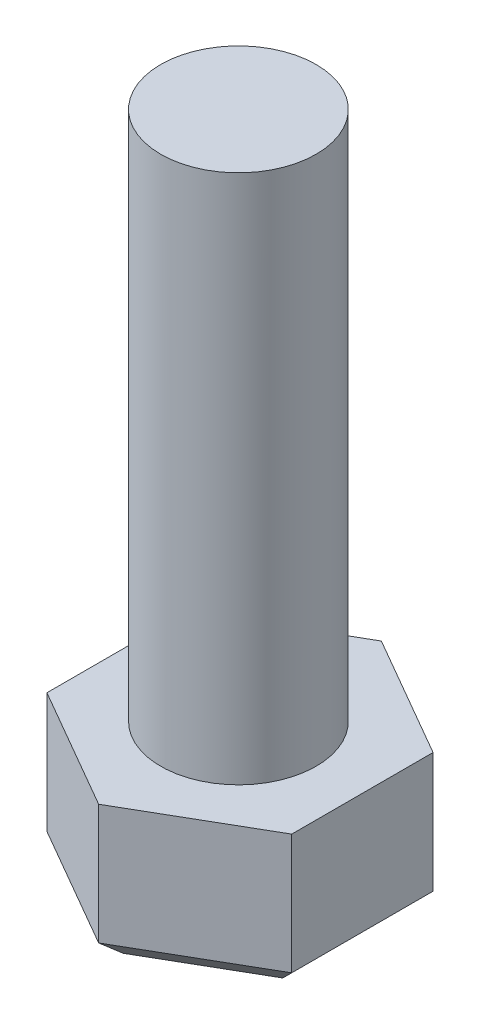
ISO-10303-21;
HEADER;
FILE_DESCRIPTION(('STEP AP214'),'2;1');
FILE_NAME('part.step','',(''),(''),'','','');
FILE_SCHEMA(('AUTOMOTIVE_DESIGN { 1 0 10303 214 1 1 1 1 }'));
ENDSEC;
DATA;
#1=APPLICATION_CONTEXT('core data for automotive mechanical design processes');
#2=APPLICATION_PROTOCOL_DEFINITION('international standard','automotive_design',2000,#1);
#3=PRODUCT_CONTEXT('',#1,'mechanical');
#4=PRODUCT('Part','Part','',(#3));
#5=PRODUCT_RELATED_PRODUCT_CATEGORY('part','',(#4));
#6=PRODUCT_DEFINITION_FORMATION('','',#4);
#7=PRODUCT_DEFINITION_CONTEXT('part definition',#1,'design');
#8=PRODUCT_DEFINITION('design','',#6,#7);
#9=PRODUCT_DEFINITION_SHAPE('','',#8);
#10=(LENGTH_UNIT() NAMED_UNIT(*) SI_UNIT(.MILLI.,.METRE.));
#11=(NAMED_UNIT(*) PLANE_ANGLE_UNIT() SI_UNIT($,.RADIAN.));
#12=(NAMED_UNIT(*) SI_UNIT($,.STERADIAN.) SOLID_ANGLE_UNIT());
#13=UNCERTAINTY_MEASURE_WITH_UNIT(LENGTH_MEASURE(1.E-05),#10,'distance_accuracy_value','');
#14=(GEOMETRIC_REPRESENTATION_CONTEXT(3) GLOBAL_UNCERTAINTY_ASSIGNED_CONTEXT((#13)) GLOBAL_UNIT_ASSIGNED_CONTEXT((#10,
#11,#12)) REPRESENTATION_CONTEXT('',''));
#15=CARTESIAN_POINT('',(0.,0.,0.));
#16=DIRECTION('',(0.,0.,1.));
#17=DIRECTION('',(1.,0.,0.));
#18=AXIS2_PLACEMENT_3D('',#15,#16,#17);
#19=CARTESIAN_POINT('',(0.,75.,-7.105427357601E-12));
#20=DIRECTION('',(0.,-1.,0.));
#21=DIRECTION('',(0.,0.,-1.));
#22=AXIS2_PLACEMENT_3D('',#19,#20,#21);
#23=CYLINDRICAL_SURFACE('',#22,11.0000000000241);
#24=CARTESIAN_POINT('',(0.,75.,-7.105427357601E-12));
#25=DIRECTION('',(0.,1.,0.));
#26=DIRECTION('',(0.,0.,1.));
#27=AXIS2_PLACEMENT_3D('',#24,#25,#26);
#28=CIRCLE('',#27,11.0000000000241);
#29=CARTESIAN_POINT('',(0.,75.,11.000000000017));
#30=VERTEX_POINT('',#29);
#31=EDGE_CURVE('E156',#30,#30,#28,.T.);
#32=ORIENTED_EDGE('',*,*,#31,.F.);
#33=EDGE_LOOP('',(#32));
#34=FACE_BOUND('',#33,.T.);
#35=CARTESIAN_POINT('',(0.,0.,-7.105427357601E-12));
#36=DIRECTION('',(0.,-1.,0.));
#37=DIRECTION('',(0.,0.,-1.));
#38=AXIS2_PLACEMENT_3D('',#35,#36,#37);
#39=CIRCLE('',#38,11.0000000000241);
#40=CARTESIAN_POINT('',(0.,0.,-11.0000000000312));
#41=VERTEX_POINT('',#40);
#42=EDGE_CURVE('E117',#41,#41,#39,.T.);
#43=ORIENTED_EDGE('',*,*,#42,.F.);
#44=EDGE_LOOP('',(#43));
#45=FACE_BOUND('',#44,.T.);
#46=ADVANCED_FACE('F37',(#34,#45),#23,.T.);
#47=CARTESIAN_POINT('',(-41.2996526108015,75.,7.10704846442876E-12));
#48=DIRECTION('',(0.,1.,0.));
#49=DIRECTION('',(0.,0.,1.));
#50=AXIS2_PLACEMENT_3D('',#47,#48,#49);
#51=PLANE('',#50);
#52=ORIENTED_EDGE('',*,*,#31,.T.);
#53=EDGE_LOOP('',(#52));
#54=FACE_BOUND('',#53,.T.);
#55=ADVANCED_FACE('F234',(#54),#51,.T.);
#56=CARTESIAN_POINT('',(0.259699184535764,0.,20.0356318971039));
#57=DIRECTION('',(0.,-1.,0.));
#58=DIRECTION('',(0.,0.,-1.));
#59=AXIS2_PLACEMENT_3D('',#56,#57,#58);
#60=PLANE('',#59);
#61=DIRECTION('',(-0.866025403784439,0.,0.5));
#62=VECTOR('',#61,1.);
#63=CARTESIAN_POINT('',(17.5802072602339,0.,10.0356318970985));
#64=LINE('',#63,#62);
#65=CARTESIAN_POINT('',(17.5802072602339,0.,10.0356318970985));
#66=VERTEX_POINT('',#65);
#67=CARTESIAN_POINT('',(0.259699184535764,0.,20.0356318971039));
#68=VERTEX_POINT('',#67);
#69=EDGE_CURVE('E125',#66,#68,#64,.T.);
#70=ORIENTED_EDGE('',*,*,#69,.F.);
#71=DIRECTION('',(0.,0.,1.));
#72=VECTOR('',#71,1.);
#73=CARTESIAN_POINT('',(17.5802072602339,0.,-9.96436810291177));
#74=LINE('',#73,#72);
#75=CARTESIAN_POINT('',(17.5802072602339,0.,-9.96436810291177));
#76=VERTEX_POINT('',#75);
#77=EDGE_CURVE('E144',#76,#66,#74,.T.);
#78=ORIENTED_EDGE('',*,*,#77,.F.);
#79=DIRECTION('',(0.866025403784439,0.,0.5));
#80=VECTOR('',#79,1.);
#81=CARTESIAN_POINT('',(0.259699184559934,0.,-19.9643681029032));
#82=LINE('',#81,#80);
#83=CARTESIAN_POINT('',(0.259699184559934,0.,-19.9643681029032));
#84=VERTEX_POINT('',#83);
#85=EDGE_CURVE('E141',#84,#76,#82,.T.);
#86=ORIENTED_EDGE('',*,*,#85,.F.);
#87=DIRECTION('',(0.866025403784439,0.,-0.5));
#88=VECTOR('',#87,1.);
#89=CARTESIAN_POINT('',(-17.0608088911628,0.,-9.9643681028836));
#90=LINE('',#89,#88);
#91=CARTESIAN_POINT('',(-17.0608088911628,0.,-9.9643681028836));
#92=VERTEX_POINT('',#91);
#93=EDGE_CURVE('E138',#92,#84,#90,.T.);
#94=ORIENTED_EDGE('',*,*,#93,.F.);
#95=DIRECTION('',(0.,0.,-1.));
#96=VECTOR('',#95,1.);
#97=CARTESIAN_POINT('',(-17.0608088911628,0.,10.0356318970982));
#98=LINE('',#97,#96);
#99=CARTESIAN_POINT('',(-17.0608088911628,0.,10.0356318970982));
#100=VERTEX_POINT('',#99);
#101=EDGE_CURVE('E128',#100,#92,#98,.T.);
#102=ORIENTED_EDGE('',*,*,#101,.F.);
#103=DIRECTION('',(-0.866025403784439,0.,-0.5));
#104=VECTOR('',#103,1.);
#105=CARTESIAN_POINT('',(0.259699184535764,0.,20.0356318971039));
#106=LINE('',#105,#104);
#107=EDGE_CURVE('E112',#68,#100,#106,.T.);
#108=ORIENTED_EDGE('',*,*,#107,.F.);
#109=EDGE_LOOP('',(#70,#78,#86,#94,#102,#108));
#110=FACE_BOUND('',#109,.T.);
#111=ORIENTED_EDGE('',*,*,#42,.T.);
#112=EDGE_LOOP('',(#111));
#113=FACE_BOUND('',#112,.T.);
#114=ADVANCED_FACE('F122',(#110,#113),#60,.F.);
#115=CARTESIAN_POINT('',(17.5802072602339,-20.,10.0356318970985));
#116=DIRECTION('',(-0.5,0.,-0.866025403784438));
#117=DIRECTION('',(-0.866025403784439,0.,0.5));
#118=AXIS2_PLACEMENT_3D('',#115,#116,#117);
#119=PLANE('',#118);
#120=DIRECTION('',(0.,1.,0.));
#121=VECTOR('',#120,1.);
#122=CARTESIAN_POINT('',(0.259699184535764,-20.,20.0356318971039));
#123=LINE('',#122,#121);
#124=CARTESIAN_POINT('',(0.259699184535764,-17.,20.0356318971039));
#125=VERTEX_POINT('',#124);
#126=EDGE_CURVE('E108',#125,#68,#123,.T.);
#127=ORIENTED_EDGE('',*,*,#126,.F.);
#128=DIRECTION('',(0.866025403784439,0.,-0.5));
#129=VECTOR('',#128,1.);
#130=CARTESIAN_POINT('',(17.5802072602339,-17.,10.0356318970985));
#131=LINE('',#130,#129);
#132=CARTESIAN_POINT('',(17.5802072602339,-17.,10.0356318970985));
#133=VERTEX_POINT('',#132);
#134=EDGE_CURVE('E61',#125,#133,#131,.T.);
#135=ORIENTED_EDGE('',*,*,#134,.T.);
#136=DIRECTION('',(0.,1.,0.));
#137=VECTOR('',#136,1.);
#138=CARTESIAN_POINT('',(17.5802072602339,-20.,10.0356318970985));
#139=LINE('',#138,#137);
#140=EDGE_CURVE('E131',#133,#66,#139,.T.);
#141=ORIENTED_EDGE('',*,*,#140,.T.);
#142=ORIENTED_EDGE('',*,*,#69,.T.);
#143=EDGE_LOOP('',(#127,#135,#141,#142));
#144=FACE_BOUND('',#143,.T.);
#145=ADVANCED_FACE('F130',(#144),#119,.F.);
#146=CARTESIAN_POINT('',(0.259699184535764,-20.,20.0356318971039));
#147=DIRECTION('',(0.5,0.,-0.866025403784439));
#148=DIRECTION('',(-0.866025403784439,0.,-0.5));
#149=AXIS2_PLACEMENT_3D('',#146,#147,#148);
#150=PLANE('',#149);
#151=DIRECTION('',(0.,1.,0.));
#152=VECTOR('',#151,1.);
#153=CARTESIAN_POINT('',(-17.0608088911628,-20.,10.0356318970982));
#154=LINE('',#153,#152);
#155=CARTESIAN_POINT('',(-17.0608088911628,-17.,10.0356318970982));
#156=VERTEX_POINT('',#155);
#157=EDGE_CURVE('E118',#156,#100,#154,.T.);
#158=ORIENTED_EDGE('',*,*,#157,.F.);
#159=DIRECTION('',(0.866025403784439,0.,0.5));
#160=VECTOR('',#159,1.);
#161=CARTESIAN_POINT('',(0.259699184535764,-17.,20.0356318971039));
#162=LINE('',#161,#160);
#163=EDGE_CURVE('E115',#156,#125,#162,.T.);
#164=ORIENTED_EDGE('',*,*,#163,.T.);
#165=ORIENTED_EDGE('',*,*,#126,.T.);
#166=ORIENTED_EDGE('',*,*,#107,.T.);
#167=EDGE_LOOP('',(#158,#164,#165,#166));
#168=FACE_BOUND('',#167,.T.);
#169=ADVANCED_FACE('F111',(#168),#150,.F.);
#170=CARTESIAN_POINT('',(-17.0608088911628,-20.,10.0356318970982));
#171=DIRECTION('',(1.,0.,0.));
#172=DIRECTION('',(0.,0.,-1.));
#173=AXIS2_PLACEMENT_3D('',#170,#171,#172);
#174=PLANE('',#173);
#175=DIRECTION('',(0.,1.,0.));
#176=VECTOR('',#175,1.);
#177=CARTESIAN_POINT('',(-17.0608088911628,-20.,-9.9643681028836));
#178=LINE('',#177,#176);
#179=CARTESIAN_POINT('',(-17.0608088911628,-17.,-9.9643681028836));
#180=VERTEX_POINT('',#179);
#181=EDGE_CURVE('E151',#180,#92,#178,.T.);
#182=ORIENTED_EDGE('',*,*,#181,.F.);
#183=DIRECTION('',(0.,0.,1.));
#184=VECTOR('',#183,1.);
#185=CARTESIAN_POINT('',(-17.0608088911628,-17.,10.0356318970982));
#186=LINE('',#185,#184);
#187=EDGE_CURVE('E175',#180,#156,#186,.T.);
#188=ORIENTED_EDGE('',*,*,#187,.T.);
#189=ORIENTED_EDGE('',*,*,#157,.T.);
#190=ORIENTED_EDGE('',*,*,#101,.T.);
#191=EDGE_LOOP('',(#182,#188,#189,#190));
#192=FACE_BOUND('',#191,.T.);
#193=ADVANCED_FACE('F224',(#192),#174,.F.);
#194=CARTESIAN_POINT('',(-17.0608088911628,-20.,-9.9643681028836));
#195=DIRECTION('',(0.5,0.,0.866025403784439));
#196=DIRECTION('',(0.866025403784439,0.,-0.5));
#197=AXIS2_PLACEMENT_3D('',#194,#195,#196);
#198=PLANE('',#197);
#199=DIRECTION('',(0.,1.,0.));
#200=VECTOR('',#199,1.);
#201=CARTESIAN_POINT('',(0.259699184559934,-20.,-19.9643681029032));
#202=LINE('',#201,#200);
#203=CARTESIAN_POINT('',(0.259699184559934,-17.,-19.9643681029032));
#204=VERTEX_POINT('',#203);
#205=EDGE_CURVE('E149',#204,#84,#202,.T.);
#206=ORIENTED_EDGE('',*,*,#205,.F.);
#207=DIRECTION('',(-0.866025403784439,0.,0.5));
#208=VECTOR('',#207,1.);
#209=CARTESIAN_POINT('',(-17.0608088911628,-17.,-9.9643681028836));
#210=LINE('',#209,#208);
#211=EDGE_CURVE('E172',#204,#180,#210,.T.);
#212=ORIENTED_EDGE('',*,*,#211,.T.);
#213=ORIENTED_EDGE('',*,*,#181,.T.);
#214=ORIENTED_EDGE('',*,*,#93,.T.);
#215=EDGE_LOOP('',(#206,#212,#213,#214));
#216=FACE_BOUND('',#215,.T.);
#217=ADVANCED_FACE('F213',(#216),#198,.F.);
#218=CARTESIAN_POINT('',(0.259699184559934,-20.,-19.9643681029032));
#219=DIRECTION('',(-0.5,0.,0.866025403784439));
#220=DIRECTION('',(0.866025403784439,0.,0.5));
#221=AXIS2_PLACEMENT_3D('',#218,#219,#220);
#222=PLANE('',#221);
#223=DIRECTION('',(0.,1.,0.));
#224=VECTOR('',#223,1.);
#225=CARTESIAN_POINT('',(17.5802072602339,-20.,-9.96436810291177));
#226=LINE('',#225,#224);
#227=CARTESIAN_POINT('',(17.5802072602339,-17.,-9.96436810291177));
#228=VERTEX_POINT('',#227);
#229=EDGE_CURVE('E147',#228,#76,#226,.T.);
#230=ORIENTED_EDGE('',*,*,#229,.F.);
#231=DIRECTION('',(-0.866025403784439,0.,-0.5));
#232=VECTOR('',#231,1.);
#233=CARTESIAN_POINT('',(0.259699184559934,-17.,-19.9643681029032));
#234=LINE('',#233,#232);
#235=EDGE_CURVE('E11',#228,#204,#234,.T.);
#236=ORIENTED_EDGE('',*,*,#235,.T.);
#237=ORIENTED_EDGE('',*,*,#205,.T.);
#238=ORIENTED_EDGE('',*,*,#85,.T.);
#239=EDGE_LOOP('',(#230,#236,#237,#238));
#240=FACE_BOUND('',#239,.T.);
#241=ADVANCED_FACE('F210',(#240),#222,.F.);
#242=CARTESIAN_POINT('',(17.5802072602339,-20.,-9.96436810291177));
#243=DIRECTION('',(-1.,0.,0.));
#244=DIRECTION('',(0.,0.,1.));
#245=AXIS2_PLACEMENT_3D('',#242,#243,#244);
#246=PLANE('',#245);
#247=ORIENTED_EDGE('',*,*,#140,.F.);
#248=DIRECTION('',(0.,0.,-1.));
#249=VECTOR('',#248,1.);
#250=CARTESIAN_POINT('',(17.5802072602339,-17.,-9.96436810291177));
#251=LINE('',#250,#249);
#252=EDGE_CURVE('E46',#133,#228,#251,.T.);
#253=ORIENTED_EDGE('',*,*,#252,.T.);
#254=ORIENTED_EDGE('',*,*,#229,.T.);
#255=ORIENTED_EDGE('',*,*,#77,.T.);
#256=EDGE_LOOP('',(#247,#253,#254,#255));
#257=FACE_BOUND('',#256,.T.);
#258=ADVANCED_FACE('F290',(#257),#246,.F.);
#259=CARTESIAN_POINT('',(0.259699184535764,-20.,20.0356318971039));
#260=DIRECTION('',(0.,-1.,0.));
#261=DIRECTION('',(0.,0.,-1.));
#262=AXIS2_PLACEMENT_3D('',#259,#260,#261);
#263=PLANE('',#262);
#264=DIRECTION('',(0.,0.,-1.));
#265=VECTOR('',#264,1.);
#266=CARTESIAN_POINT('',(-14.0608088911628,-20.,-9.9643681028836));
#267=LINE('',#266,#265);
#268=CARTESIAN_POINT('',(-14.0608088911628,-20.,8.30358108952932));
#269=VERTEX_POINT('',#268);
#270=CARTESIAN_POINT('',(-14.0608088911628,-20.,-8.23231729531472));
#271=VERTEX_POINT('',#270);
#272=EDGE_CURVE('E167',#269,#271,#267,.T.);
#273=ORIENTED_EDGE('',*,*,#272,.T.);
#274=DIRECTION('',(0.866025403784439,0.,-0.5));
#275=VECTOR('',#274,1.);
#276=CARTESIAN_POINT('',(1.75969918455994,-20.,-17.3662918915499));
#277=LINE('',#276,#275);
#278=CARTESIAN_POINT('',(0.259699184559934,-20.,-16.5002664877655));
#279=VERTEX_POINT('',#278);
#280=EDGE_CURVE('E169',#271,#279,#277,.T.);
#281=ORIENTED_EDGE('',*,*,#280,.T.);
#282=DIRECTION('',(0.866025403784439,0.,0.5));
#283=VECTOR('',#282,1.);
#284=CARTESIAN_POINT('',(16.0802072602339,-20.,-7.36629189155844));
#285=LINE('',#284,#283);
#286=CARTESIAN_POINT('',(14.5802072602339,-20.,-8.23231729534288));
#287=VERTEX_POINT('',#286);
#288=EDGE_CURVE('E159',#279,#287,#285,.T.);
#289=ORIENTED_EDGE('',*,*,#288,.T.);
#290=DIRECTION('',(0.,0.,1.));
#291=VECTOR('',#290,1.);
#292=CARTESIAN_POINT('',(14.5802072602339,-20.,10.0356318970985));
#293=LINE('',#292,#291);
#294=CARTESIAN_POINT('',(14.5802072602339,-20.,8.30358108952958));
#295=VERTEX_POINT('',#294);
#296=EDGE_CURVE('E161',#287,#295,#293,.T.);
#297=ORIENTED_EDGE('',*,*,#296,.T.);
#298=DIRECTION('',(-0.866025403784439,0.,0.5));
#299=VECTOR('',#298,1.);
#300=CARTESIAN_POINT('',(-1.24030081546424,-20.,17.4375556857506));
#301=LINE('',#300,#299);
#302=CARTESIAN_POINT('',(0.259699184535762,-20.,16.5715302819661));
#303=VERTEX_POINT('',#302);
#304=EDGE_CURVE('E163',#295,#303,#301,.T.);
#305=ORIENTED_EDGE('',*,*,#304,.T.);
#306=DIRECTION('',(-0.866025403784439,0.,-0.5));
#307=VECTOR('',#306,1.);
#308=CARTESIAN_POINT('',(-15.5608088911628,-20.,7.43755568574488));
#309=LINE('',#308,#307);
#310=EDGE_CURVE('E165',#303,#269,#309,.T.);
#311=ORIENTED_EDGE('',*,*,#310,.T.);
#312=EDGE_LOOP('',(#273,#281,#289,#297,#305,#311));
#313=FACE_BOUND('',#312,.T.);
#314=ADVANCED_FACE('F200',(#313),#263,.T.);
#315=CARTESIAN_POINT('',(-1.24030081546424,-20.,17.4375556857506));
#316=DIRECTION('',(0.353553390593275,-0.707106781186546,0.612372435695796));
#317=DIRECTION('',(0.,-0.654653670707979,-0.755928946018453));
#318=AXIS2_PLACEMENT_3D('',#315,#316,#317);
#319=PLANE('',#318);
#320=DIRECTION('',(-0.654653670707976,-0.654653670707979,-0.377964473009227));
#321=VECTOR('',#320,1.);
#322=CARTESIAN_POINT('',(17.4831369853336,-17.0970702749003,9.97958834775447));
#323=LINE('',#322,#321);
#324=EDGE_CURVE('E135',#133,#295,#323,.T.);
#325=ORIENTED_EDGE('',*,*,#324,.F.);
#326=ORIENTED_EDGE('',*,*,#134,.F.);
#327=DIRECTION('',(0.,-0.654653670707979,-0.755928946018453));
#328=VECTOR('',#327,1.);
#329=CARTESIAN_POINT('',(0.259699184535764,-19.5714285714286,17.0664019412715));
#330=LINE('',#329,#328);
#331=EDGE_CURVE('E41',#303,#125,#330,.F.);
#332=ORIENTED_EDGE('',*,*,#331,.F.);
#333=ORIENTED_EDGE('',*,*,#304,.F.);
#334=EDGE_LOOP('',(#325,#326,#332,#333));
#335=FACE_BOUND('',#334,.T.);
#336=ADVANCED_FACE('F39',(#335),#319,.T.);
#337=CARTESIAN_POINT('',(1.75969918453577,-20.,17.4375556857506));
#338=DIRECTION('',(-0.353553390593275,-0.707106781186546,0.612372435695796));
#339=DIRECTION('',(0.,-0.654653670707979,-0.755928946018453));
#340=AXIS2_PLACEMENT_3D('',#337,#338,#339);
#341=PLANE('',#340);
#342=ORIENTED_EDGE('',*,*,#331,.T.);
#343=ORIENTED_EDGE('',*,*,#163,.F.);
#344=DIRECTION('',(0.654653670707976,-0.654653670707979,-0.377964473009226));
#345=VECTOR('',#344,1.);
#346=CARTESIAN_POINT('',(-9.54066372667753,-24.5201451644853,5.69387406203755));
#347=LINE('',#346,#345);
#348=EDGE_CURVE('E187',#269,#156,#347,.F.);
#349=ORIENTED_EDGE('',*,*,#348,.F.);
#350=ORIENTED_EDGE('',*,*,#310,.F.);
#351=EDGE_LOOP('',(#342,#343,#349,#350));
#352=FACE_BOUND('',#351,.T.);
#353=ADVANCED_FACE('F226',(#352),#341,.T.);
#354=CARTESIAN_POINT('',(14.5802072602339,-20.,20.0356318971039));
#355=DIRECTION('',(0.707106781186549,-0.707106781186546,0.));
#356=DIRECTION('',(0.707106781186546,0.707106781186549,0.));
#357=AXIS2_PLACEMENT_3D('',#354,#355,#356);
#358=PLANE('',#357);
#359=ORIENTED_EDGE('',*,*,#324,.T.);
#360=ORIENTED_EDGE('',*,*,#296,.F.);
#361=DIRECTION('',(-0.654653670707976,-0.654653670707979,0.377964473009227));
#362=VECTOR('',#361,1.);
#363=CARTESIAN_POINT('',(15.0087786888053,-19.5714285714286,-8.47975312499554));
#364=LINE('',#363,#362);
#365=EDGE_CURVE('E184',#228,#287,#364,.T.);
#366=ORIENTED_EDGE('',*,*,#365,.F.);
#367=ORIENTED_EDGE('',*,*,#252,.F.);
#368=EDGE_LOOP('',(#359,#360,#366,#367));
#369=FACE_BOUND('',#368,.T.);
#370=ADVANCED_FACE('F193',(#369),#358,.T.);
#371=CARTESIAN_POINT('',(-14.0608088911628,-20.,20.0356318971039));
#372=DIRECTION('',(-0.707106781186549,-0.707106781186546,0.));
#373=DIRECTION('',(0.707106781186546,-0.707106781186549,0.));
#374=AXIS2_PLACEMENT_3D('',#371,#372,#373);
#375=PLANE('',#374);
#376=ORIENTED_EDGE('',*,*,#348,.T.);
#377=ORIENTED_EDGE('',*,*,#187,.F.);
#378=DIRECTION('',(0.654653670707976,-0.654653670707979,0.377964473009227));
#379=VECTOR('',#378,1.);
#380=CARTESIAN_POINT('',(-7.06630543015647,-26.9945034610064,-4.19403883925492));
#381=LINE('',#380,#379);
#382=EDGE_CURVE('E182',#271,#180,#381,.F.);
#383=ORIENTED_EDGE('',*,*,#382,.F.);
#384=ORIENTED_EDGE('',*,*,#272,.F.);
#385=EDGE_LOOP('',(#376,#377,#383,#384));
#386=FACE_BOUND('',#385,.T.);
#387=ADVANCED_FACE('F222',(#386),#375,.T.);
#388=CARTESIAN_POINT('',(16.0802072602336,-20.,-7.36629189155859));
#389=DIRECTION('',(0.353553390593275,-0.707106781186546,-0.612372435695796));
#390=DIRECTION('',(0.,0.654653670707979,-0.755928946018453));
#391=AXIS2_PLACEMENT_3D('',#388,#389,#390);
#392=PLANE('',#391);
#393=ORIENTED_EDGE('',*,*,#365,.T.);
#394=ORIENTED_EDGE('',*,*,#288,.F.);
#395=DIRECTION('',(0.,0.654653670707979,-0.755928946018453));
#396=VECTOR('',#395,1.);
#397=CARTESIAN_POINT('',(0.259699184559935,-24.5201451644782,-11.2808524327901));
#398=LINE('',#397,#396);
#399=EDGE_CURVE('E180',#204,#279,#398,.F.);
#400=ORIENTED_EDGE('',*,*,#399,.F.);
#401=ORIENTED_EDGE('',*,*,#235,.F.);
#402=EDGE_LOOP('',(#393,#394,#400,#401));
#403=FACE_BOUND('',#402,.T.);
#404=ADVANCED_FACE('F206',(#403),#392,.T.);
#405=CARTESIAN_POINT('',(-15.56080889115,-20.,-7.36629189153766));
#406=DIRECTION('',(-0.353553390593275,-0.707106781186546,-0.612372435695796));
#407=DIRECTION('',(0.,0.654653670707979,-0.755928946018453));
#408=AXIS2_PLACEMENT_3D('',#405,#406,#407);
#409=PLANE('',#408);
#410=ORIENTED_EDGE('',*,*,#382,.T.);
#411=ORIENTED_EDGE('',*,*,#211,.F.);
#412=ORIENTED_EDGE('',*,*,#399,.T.);
#413=ORIENTED_EDGE('',*,*,#280,.F.);
#414=EDGE_LOOP('',(#410,#411,#412,#413));
#415=FACE_BOUND('',#414,.T.);
#416=ADVANCED_FACE('F217',(#415),#409,.T.);
#417=CLOSED_SHELL('',(#46,#55,#114,#145,#169,#193,#217,#241,#258,#314,#336,#353,#370,#387,#404,#416));
#418=MANIFOLD_SOLID_BREP('B2',#417);
#419=ADVANCED_BREP_SHAPE_REPRESENTATION('',(#18,#418),#14);
#420=SHAPE_DEFINITION_REPRESENTATION(#9,#419);
ENDSEC;
END-ISO-10303-21;
